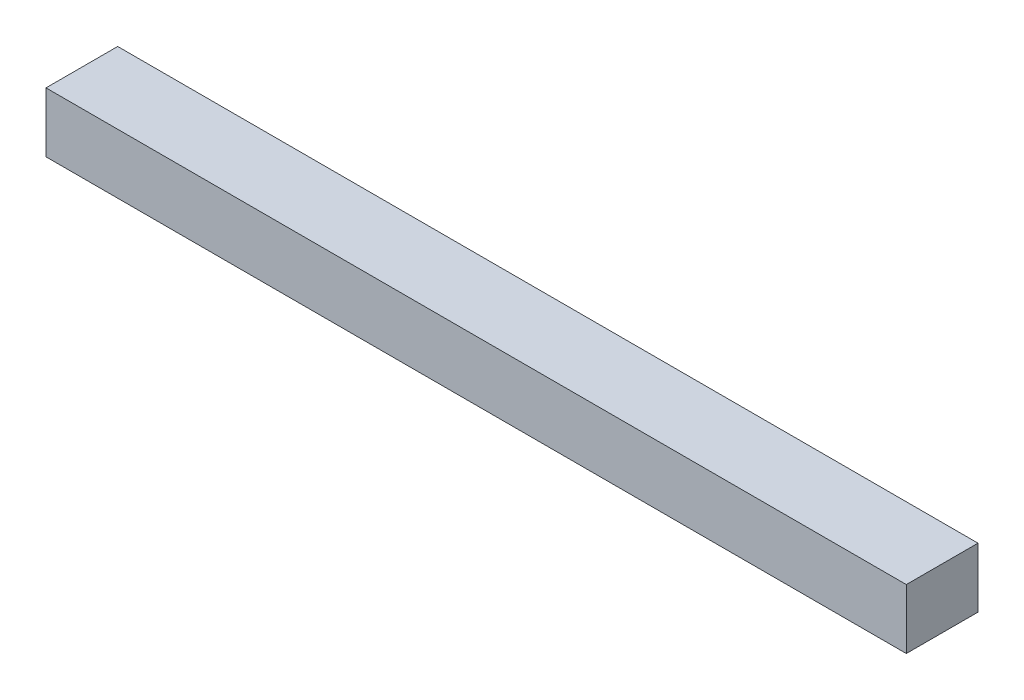
ISO-10303-21;
HEADER;
FILE_DESCRIPTION(('STEP AP214'),'2;1');
FILE_NAME('part.step','',(''),(''),'','','');
FILE_SCHEMA(('AUTOMOTIVE_DESIGN { 1 0 10303 214 1 1 1 1 }'));
ENDSEC;
DATA;
#1=APPLICATION_CONTEXT('core data for automotive mechanical design processes');
#2=APPLICATION_PROTOCOL_DEFINITION('international standard','automotive_design',2000,#1);
#3=PRODUCT_CONTEXT('',#1,'mechanical');
#4=PRODUCT('Part','Part','',(#3));
#5=PRODUCT_RELATED_PRODUCT_CATEGORY('part','',(#4));
#6=PRODUCT_DEFINITION_FORMATION('','',#4);
#7=PRODUCT_DEFINITION_CONTEXT('part definition',#1,'design');
#8=PRODUCT_DEFINITION('design','',#6,#7);
#9=PRODUCT_DEFINITION_SHAPE('','',#8);
#10=(LENGTH_UNIT() NAMED_UNIT(*) SI_UNIT(.MILLI.,.METRE.));
#11=(NAMED_UNIT(*) PLANE_ANGLE_UNIT() SI_UNIT($,.RADIAN.));
#12=(NAMED_UNIT(*) SI_UNIT($,.STERADIAN.) SOLID_ANGLE_UNIT());
#13=UNCERTAINTY_MEASURE_WITH_UNIT(LENGTH_MEASURE(1.E-05),#10,'distance_accuracy_value','');
#14=(GEOMETRIC_REPRESENTATION_CONTEXT(3) GLOBAL_UNCERTAINTY_ASSIGNED_CONTEXT((#13)) GLOBAL_UNIT_ASSIGNED_CONTEXT((#10,
#11,#12)) REPRESENTATION_CONTEXT('',''));
#15=CARTESIAN_POINT('',(0.,0.,0.));
#16=DIRECTION('',(0.,0.,1.));
#17=DIRECTION('',(1.,0.,0.));
#18=AXIS2_PLACEMENT_3D('',#15,#16,#17);
#19=CARTESIAN_POINT('',(360.,-12.5,-15.));
#20=DIRECTION('',(0.,0.,1.));
#21=DIRECTION('',(1.,0.,0.));
#22=AXIS2_PLACEMENT_3D('',#19,#20,#21);
#23=PLANE('',#22);
#24=DIRECTION('',(0.,1.,0.));
#25=VECTOR('',#24,1.);
#26=CARTESIAN_POINT('',(0.,-12.5,-15.));
#27=LINE('',#26,#25);
#28=CARTESIAN_POINT('',(0.,-12.5,-15.));
#29=VERTEX_POINT('',#28);
#30=CARTESIAN_POINT('',(0.,12.5,-15.));
#31=VERTEX_POINT('',#30);
#32=EDGE_CURVE('E100',#29,#31,#27,.T.);
#33=ORIENTED_EDGE('',*,*,#32,.T.);
#34=DIRECTION('',(-1.,0.,0.));
#35=VECTOR('',#34,1.);
#36=CARTESIAN_POINT('',(360.,12.5,-15.));
#37=LINE('',#36,#35);
#38=CARTESIAN_POINT('',(360.,12.5,-15.));
#39=VERTEX_POINT('',#38);
#40=EDGE_CURVE('E11',#39,#31,#37,.T.);
#41=ORIENTED_EDGE('',*,*,#40,.F.);
#42=DIRECTION('',(0.,1.,0.));
#43=VECTOR('',#42,1.);
#44=CARTESIAN_POINT('',(360.,-12.5,-15.));
#45=LINE('',#44,#43);
#46=CARTESIAN_POINT('',(360.,-12.5,-15.));
#47=VERTEX_POINT('',#46);
#48=EDGE_CURVE('E88',#47,#39,#45,.T.);
#49=ORIENTED_EDGE('',*,*,#48,.F.);
#50=DIRECTION('',(-1.,0.,0.));
#51=VECTOR('',#50,1.);
#52=CARTESIAN_POINT('',(360.,-12.5,-15.));
#53=LINE('',#52,#51);
#54=EDGE_CURVE('E96',#47,#29,#53,.T.);
#55=ORIENTED_EDGE('',*,*,#54,.T.);
#56=EDGE_LOOP('',(#33,#41,#49,#55));
#57=FACE_BOUND('',#56,.T.);
#58=ADVANCED_FACE('F37',(#57),#23,.F.);
#59=CARTESIAN_POINT('',(360.,12.5,15.));
#60=DIRECTION('',(0.,-1.,0.));
#61=DIRECTION('',(0.,0.,-1.));
#62=AXIS2_PLACEMENT_3D('',#59,#60,#61);
#63=PLANE('',#62);
#64=DIRECTION('',(0.,0.,1.));
#65=VECTOR('',#64,1.);
#66=CARTESIAN_POINT('',(0.,12.5,15.));
#67=LINE('',#66,#65);
#68=CARTESIAN_POINT('',(0.,12.5,15.));
#69=VERTEX_POINT('',#68);
#70=EDGE_CURVE('E92',#31,#69,#67,.T.);
#71=ORIENTED_EDGE('',*,*,#70,.T.);
#72=DIRECTION('',(-1.,0.,0.));
#73=VECTOR('',#72,1.);
#74=CARTESIAN_POINT('',(360.,12.5,15.));
#75=LINE('',#74,#73);
#76=CARTESIAN_POINT('',(360.,12.5,15.));
#77=VERTEX_POINT('',#76);
#78=EDGE_CURVE('E45',#77,#69,#75,.T.);
#79=ORIENTED_EDGE('',*,*,#78,.F.);
#80=DIRECTION('',(0.,0.,1.));
#81=VECTOR('',#80,1.);
#82=CARTESIAN_POINT('',(360.,12.5,15.));
#83=LINE('',#82,#81);
#84=EDGE_CURVE('E83',#39,#77,#83,.T.);
#85=ORIENTED_EDGE('',*,*,#84,.F.);
#86=ORIENTED_EDGE('',*,*,#40,.T.);
#87=EDGE_LOOP('',(#71,#79,#85,#86));
#88=FACE_BOUND('',#87,.T.);
#89=ADVANCED_FACE('F91',(#88),#63,.F.);
#90=CARTESIAN_POINT('',(360.,-12.5,15.));
#91=DIRECTION('',(0.,0.,-1.));
#92=DIRECTION('',(-1.,0.,0.));
#93=AXIS2_PLACEMENT_3D('',#90,#91,#92);
#94=PLANE('',#93);
#95=DIRECTION('',(0.,-1.,0.));
#96=VECTOR('',#95,1.);
#97=CARTESIAN_POINT('',(0.,-12.5,15.));
#98=LINE('',#97,#96);
#99=CARTESIAN_POINT('',(0.,-12.5,15.));
#100=VERTEX_POINT('',#99);
#101=EDGE_CURVE('E70',#69,#100,#98,.T.);
#102=ORIENTED_EDGE('',*,*,#101,.T.);
#103=DIRECTION('',(-1.,0.,0.));
#104=VECTOR('',#103,1.);
#105=CARTESIAN_POINT('',(360.,-12.5,15.));
#106=LINE('',#105,#104);
#107=CARTESIAN_POINT('',(360.,-12.5,15.));
#108=VERTEX_POINT('',#107);
#109=EDGE_CURVE('E93',#108,#100,#106,.T.);
#110=ORIENTED_EDGE('',*,*,#109,.F.);
#111=DIRECTION('',(0.,-1.,0.));
#112=VECTOR('',#111,1.);
#113=CARTESIAN_POINT('',(360.,-12.5,15.));
#114=LINE('',#113,#112);
#115=EDGE_CURVE('E86',#77,#108,#114,.T.);
#116=ORIENTED_EDGE('',*,*,#115,.F.);
#117=ORIENTED_EDGE('',*,*,#78,.T.);
#118=EDGE_LOOP('',(#102,#110,#116,#117));
#119=FACE_BOUND('',#118,.T.);
#120=ADVANCED_FACE('F94',(#119),#94,.F.);
#121=CARTESIAN_POINT('',(360.,-12.5,15.));
#122=DIRECTION('',(0.,1.,0.));
#123=DIRECTION('',(0.,0.,1.));
#124=AXIS2_PLACEMENT_3D('',#121,#122,#123);
#125=PLANE('',#124);
#126=DIRECTION('',(0.,0.,-1.));
#127=VECTOR('',#126,1.);
#128=CARTESIAN_POINT('',(0.,-12.5,15.));
#129=LINE('',#128,#127);
#130=EDGE_CURVE('E76',#100,#29,#129,.T.);
#131=ORIENTED_EDGE('',*,*,#130,.T.);
#132=ORIENTED_EDGE('',*,*,#54,.F.);
#133=DIRECTION('',(0.,0.,-1.));
#134=VECTOR('',#133,1.);
#135=CARTESIAN_POINT('',(360.,-12.5,15.));
#136=LINE('',#135,#134);
#137=EDGE_CURVE('E53',#108,#47,#136,.T.);
#138=ORIENTED_EDGE('',*,*,#137,.F.);
#139=ORIENTED_EDGE('',*,*,#109,.T.);
#140=EDGE_LOOP('',(#131,#132,#138,#139));
#141=FACE_BOUND('',#140,.T.);
#142=ADVANCED_FACE('F107',(#141),#125,.F.);
#143=CARTESIAN_POINT('',(360.,0.,0.));
#144=DIRECTION('',(-1.,0.,0.));
#145=DIRECTION('',(0.,0.,1.));
#146=AXIS2_PLACEMENT_3D('',#143,#144,#145);
#147=PLANE('',#146);
#148=ORIENTED_EDGE('',*,*,#48,.T.);
#149=ORIENTED_EDGE('',*,*,#84,.T.);
#150=ORIENTED_EDGE('',*,*,#115,.T.);
#151=ORIENTED_EDGE('',*,*,#137,.T.);
#152=EDGE_LOOP('',(#148,#149,#150,#151));
#153=FACE_BOUND('',#152,.T.);
#154=ADVANCED_FACE('F84',(#153),#147,.F.);
#155=CARTESIAN_POINT('',(0.,0.,0.));
#156=DIRECTION('',(-1.,0.,0.));
#157=DIRECTION('',(0.,0.,1.));
#158=AXIS2_PLACEMENT_3D('',#155,#156,#157);
#159=PLANE('',#158);
#160=ORIENTED_EDGE('',*,*,#32,.F.);
#161=ORIENTED_EDGE('',*,*,#130,.F.);
#162=ORIENTED_EDGE('',*,*,#101,.F.);
#163=ORIENTED_EDGE('',*,*,#70,.F.);
#164=EDGE_LOOP('',(#160,#161,#162,#163));
#165=FACE_BOUND('',#164,.T.);
#166=ADVANCED_FACE('F110',(#165),#159,.T.);
#167=CLOSED_SHELL('',(#58,#89,#120,#142,#154,#166));
#168=MANIFOLD_SOLID_BREP('B2',#167);
#169=ADVANCED_BREP_SHAPE_REPRESENTATION('',(#18,#168),#14);
#170=SHAPE_DEFINITION_REPRESENTATION(#9,#169);
ENDSEC;
END-ISO-10303-21;
